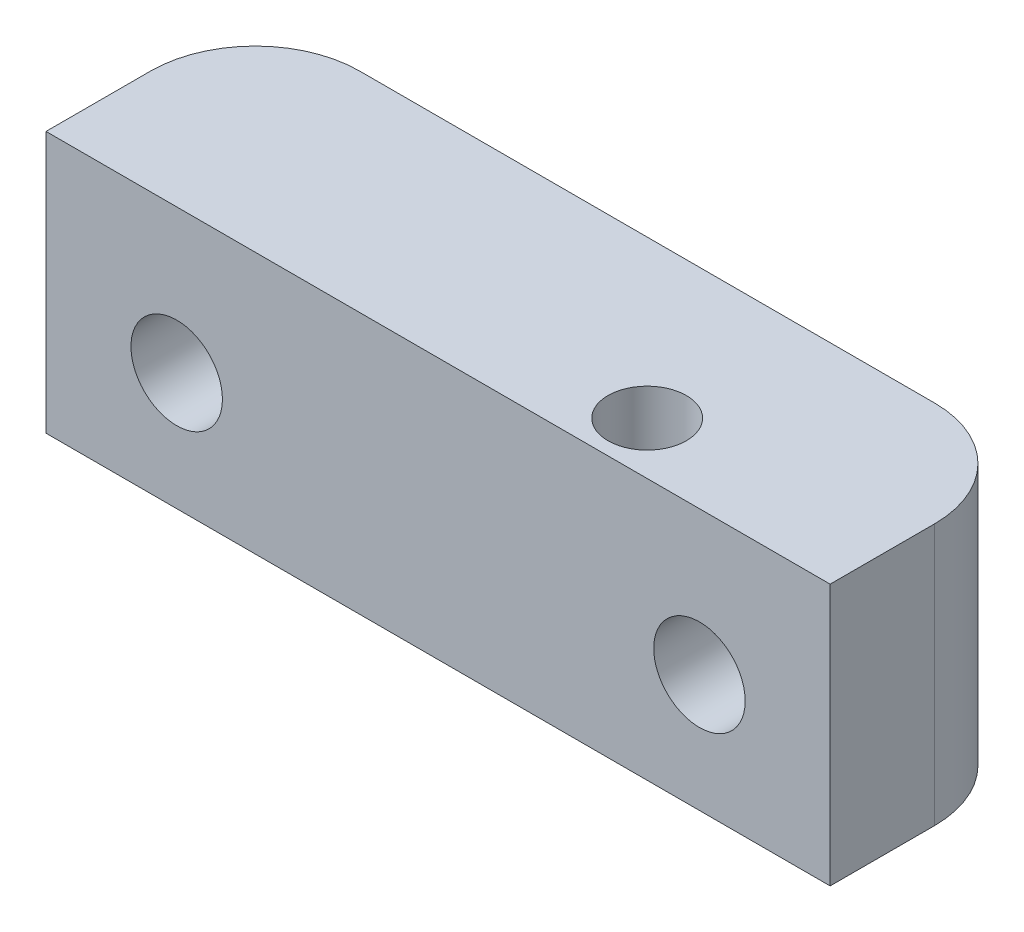
ISO-10303-21;
HEADER;
FILE_DESCRIPTION(('STEP AP214'),'2;1');
FILE_NAME('part.step','',(''),(''),'','','');
FILE_SCHEMA(('AUTOMOTIVE_DESIGN { 1 0 10303 214 1 1 1 1 }'));
ENDSEC;
DATA;
#1=APPLICATION_CONTEXT('core data for automotive mechanical design processes');
#2=APPLICATION_PROTOCOL_DEFINITION('international standard','automotive_design',2000,#1);
#3=PRODUCT_CONTEXT('',#1,'mechanical');
#4=PRODUCT('Part','Part','',(#3));
#5=PRODUCT_RELATED_PRODUCT_CATEGORY('part','',(#4));
#6=PRODUCT_DEFINITION_FORMATION('','',#4);
#7=PRODUCT_DEFINITION_CONTEXT('part definition',#1,'design');
#8=PRODUCT_DEFINITION('design','',#6,#7);
#9=PRODUCT_DEFINITION_SHAPE('','',#8);
#10=(LENGTH_UNIT() NAMED_UNIT(*) SI_UNIT(.MILLI.,.METRE.));
#11=(NAMED_UNIT(*) PLANE_ANGLE_UNIT() SI_UNIT($,.RADIAN.));
#12=(NAMED_UNIT(*) SI_UNIT($,.STERADIAN.) SOLID_ANGLE_UNIT());
#13=UNCERTAINTY_MEASURE_WITH_UNIT(LENGTH_MEASURE(1.E-05),#10,'distance_accuracy_value','');
#14=(GEOMETRIC_REPRESENTATION_CONTEXT(3) GLOBAL_UNCERTAINTY_ASSIGNED_CONTEXT((#13)) GLOBAL_UNIT_ASSIGNED_CONTEXT((#10,
#11,#12)) REPRESENTATION_CONTEXT('',''));
#15=CARTESIAN_POINT('',(0.,0.,0.));
#16=DIRECTION('',(0.,0.,1.));
#17=DIRECTION('',(1.,0.,0.));
#18=AXIS2_PLACEMENT_3D('',#15,#16,#17);
#19=CARTESIAN_POINT('',(0.,2.,0.));
#20=DIRECTION('',(0.,1.,0.));
#21=DIRECTION('',(0.,0.,1.));
#22=AXIS2_PLACEMENT_3D('',#19,#20,#21);
#23=PLANE('',#22);
#24=DIRECTION('',(0.,0.,-1.));
#25=VECTOR('',#24,1.);
#26=CARTESIAN_POINT('',(15.,2.,-4.));
#27=LINE('',#26,#25);
#28=CARTESIAN_POINT('',(15.,2.,4.));
#29=VERTEX_POINT('',#28);
#30=CARTESIAN_POINT('',(15.,2.,0.));
#31=VERTEX_POINT('',#30);
#32=EDGE_CURVE('E147',#29,#31,#27,.T.);
#33=ORIENTED_EDGE('',*,*,#32,.T.);
#34=CARTESIAN_POINT('',(11.,2.,0.));
#35=DIRECTION('',(0.,1.,0.));
#36=DIRECTION('',(0.,0.,1.));
#37=AXIS2_PLACEMENT_3D('',#34,#35,#36);
#38=CIRCLE('',#37,4.);
#39=CARTESIAN_POINT('',(11.,2.,-4.));
#40=VERTEX_POINT('',#39);
#41=EDGE_CURVE('E210',#31,#40,#38,.T.);
#42=ORIENTED_EDGE('',*,*,#41,.T.);
#43=DIRECTION('',(-1.,0.,0.));
#44=VECTOR('',#43,1.);
#45=CARTESIAN_POINT('',(-15.,2.,-4.));
#46=LINE('',#45,#44);
#47=CARTESIAN_POINT('',(-11.,2.,-4.));
#48=VERTEX_POINT('',#47);
#49=EDGE_CURVE('E149',#40,#48,#46,.T.);
#50=ORIENTED_EDGE('',*,*,#49,.T.);
#51=CARTESIAN_POINT('',(-11.,2.,0.));
#52=DIRECTION('',(0.,1.,0.));
#53=DIRECTION('',(0.,0.,1.));
#54=AXIS2_PLACEMENT_3D('',#51,#52,#53);
#55=CIRCLE('',#54,4.);
#56=CARTESIAN_POINT('',(-15.,2.,0.));
#57=VERTEX_POINT('',#56);
#58=EDGE_CURVE('E55',#48,#57,#55,.T.);
#59=ORIENTED_EDGE('',*,*,#58,.T.);
#60=DIRECTION('',(0.,0.,1.));
#61=VECTOR('',#60,1.);
#62=CARTESIAN_POINT('',(-15.,2.,-4.));
#63=LINE('',#62,#61);
#64=CARTESIAN_POINT('',(-15.,2.,4.));
#65=VERTEX_POINT('',#64);
#66=EDGE_CURVE('E151',#57,#65,#63,.T.);
#67=ORIENTED_EDGE('',*,*,#66,.T.);
#68=DIRECTION('',(1.,0.,0.));
#69=VECTOR('',#68,1.);
#70=CARTESIAN_POINT('',(-15.,2.,4.));
#71=LINE('',#70,#69);
#72=EDGE_CURVE('E124',#65,#29,#71,.T.);
#73=ORIENTED_EDGE('',*,*,#72,.T.);
#74=EDGE_LOOP('',(#33,#42,#50,#59,#67,#73));
#75=FACE_BOUND('',#74,.T.);
#76=CARTESIAN_POINT('',(5.99999999999999,2.,2.));
#77=DIRECTION('',(0.,1.,0.));
#78=DIRECTION('',(0.,0.,1.));
#79=AXIS2_PLACEMENT_3D('',#76,#77,#78);
#80=CIRCLE('',#79,1.5);
#81=CARTESIAN_POINT('',(5.99999999999999,2.,3.5));
#82=VERTEX_POINT('',#81);
#83=EDGE_CURVE('E144',#82,#82,#80,.T.);
#84=ORIENTED_EDGE('',*,*,#83,.F.);
#85=EDGE_LOOP('',(#84));
#86=FACE_BOUND('',#85,.T.);
#87=ADVANCED_FACE('F34',(#75,#86),#23,.T.);
#88=CARTESIAN_POINT('',(15.,2.,-4.));
#89=DIRECTION('',(-1.,0.,0.));
#90=DIRECTION('',(0.,0.,1.));
#91=AXIS2_PLACEMENT_3D('',#88,#89,#90);
#92=PLANE('',#91);
#93=DIRECTION('',(0.,0.,1.));
#94=VECTOR('',#93,1.);
#95=CARTESIAN_POINT('',(15.,-8.,-35.0483493925201));
#96=LINE('',#95,#94);
#97=CARTESIAN_POINT('',(15.,-8.,0.));
#98=VERTEX_POINT('',#97);
#99=CARTESIAN_POINT('',(15.,-8.,4.));
#100=VERTEX_POINT('',#99);
#101=EDGE_CURVE('E116',#98,#100,#96,.T.);
#102=ORIENTED_EDGE('',*,*,#101,.F.);
#103=DIRECTION('',(0.,-1.,0.));
#104=VECTOR('',#103,1.);
#105=CARTESIAN_POINT('',(15.,2.,0.));
#106=LINE('',#105,#104);
#107=EDGE_CURVE('E63',#98,#31,#106,.F.);
#108=ORIENTED_EDGE('',*,*,#107,.T.);
#109=ORIENTED_EDGE('',*,*,#32,.F.);
#110=DIRECTION('',(0.,-1.,0.));
#111=VECTOR('',#110,1.);
#112=CARTESIAN_POINT('',(15.,2.,4.));
#113=LINE('',#112,#111);
#114=EDGE_CURVE('E126',#29,#100,#113,.T.);
#115=ORIENTED_EDGE('',*,*,#114,.T.);
#116=EDGE_LOOP('',(#102,#108,#109,#115));
#117=FACE_BOUND('',#116,.T.);
#118=ADVANCED_FACE('F193',(#117),#92,.F.);
#119=CARTESIAN_POINT('',(-15.,2.,-4.));
#120=DIRECTION('',(0.,0.,1.));
#121=DIRECTION('',(1.,0.,0.));
#122=AXIS2_PLACEMENT_3D('',#119,#120,#121);
#123=PLANE('',#122);
#124=ORIENTED_EDGE('',*,*,#49,.F.);
#125=DIRECTION('',(0.,-1.,0.));
#126=VECTOR('',#125,1.);
#127=CARTESIAN_POINT('',(11.,2.,-4.));
#128=LINE('',#127,#126);
#129=CARTESIAN_POINT('',(11.,-2.06385933836549,-4.));
#130=VERTEX_POINT('',#129);
#131=EDGE_CURVE('E160',#40,#130,#128,.T.);
#132=ORIENTED_EDGE('',*,*,#131,.T.);
#133=CARTESIAN_POINT('',(10.,-3.5,-4.));
#134=DIRECTION('',(0.,0.,1.));
#135=DIRECTION('',(1.,0.,0.));
#136=AXIS2_PLACEMENT_3D('',#133,#134,#135);
#137=CIRCLE('',#136,1.75);
#138=CARTESIAN_POINT('',(11.,-4.93614066163451,-4.));
#139=VERTEX_POINT('',#138);
#140=EDGE_CURVE('E140',#139,#130,#137,.F.);
#141=ORIENTED_EDGE('',*,*,#140,.F.);
#142=DIRECTION('',(0.,-1.,0.));
#143=VECTOR('',#142,1.);
#144=CARTESIAN_POINT('',(11.,2.,-4.));
#145=LINE('',#144,#143);
#146=CARTESIAN_POINT('',(11.,-8.,-4.));
#147=VERTEX_POINT('',#146);
#148=EDGE_CURVE('E158',#139,#147,#145,.T.);
#149=ORIENTED_EDGE('',*,*,#148,.T.);
#150=DIRECTION('',(-1.,0.,0.));
#151=VECTOR('',#150,1.);
#152=CARTESIAN_POINT('',(15.,-8.,-4.));
#153=LINE('',#152,#151);
#154=CARTESIAN_POINT('',(-11.,-8.,-4.));
#155=VERTEX_POINT('',#154);
#156=EDGE_CURVE('E138',#147,#155,#153,.T.);
#157=ORIENTED_EDGE('',*,*,#156,.T.);
#158=DIRECTION('',(0.,-1.,0.));
#159=VECTOR('',#158,1.);
#160=CARTESIAN_POINT('',(-11.,2.,-4.));
#161=LINE('',#160,#159);
#162=CARTESIAN_POINT('',(-11.,-4.9361406616345,-4.));
#163=VERTEX_POINT('',#162);
#164=EDGE_CURVE('E156',#155,#163,#161,.F.);
#165=ORIENTED_EDGE('',*,*,#164,.T.);
#166=CARTESIAN_POINT('',(-10.,-3.5,-4.));
#167=DIRECTION('',(0.,0.,1.));
#168=DIRECTION('',(1.,0.,0.));
#169=AXIS2_PLACEMENT_3D('',#166,#167,#168);
#170=CIRCLE('',#169,1.75);
#171=CARTESIAN_POINT('',(-11.,-2.0638593383655,-4.));
#172=VERTEX_POINT('',#171);
#173=EDGE_CURVE('E143',#172,#163,#170,.F.);
#174=ORIENTED_EDGE('',*,*,#173,.F.);
#175=DIRECTION('',(0.,-1.,0.));
#176=VECTOR('',#175,1.);
#177=CARTESIAN_POINT('',(-11.,2.,-4.));
#178=LINE('',#177,#176);
#179=EDGE_CURVE('E125',#172,#48,#178,.F.);
#180=ORIENTED_EDGE('',*,*,#179,.T.);
#181=EDGE_LOOP('',(#124,#132,#141,#149,#157,#165,#174,#180));
#182=FACE_BOUND('',#181,.T.);
#183=ADVANCED_FACE('F198',(#182),#123,.F.);
#184=CARTESIAN_POINT('',(-15.,2.,-4.));
#185=DIRECTION('',(1.,0.,0.));
#186=DIRECTION('',(0.,0.,-1.));
#187=AXIS2_PLACEMENT_3D('',#184,#185,#186);
#188=PLANE('',#187);
#189=ORIENTED_EDGE('',*,*,#66,.F.);
#190=DIRECTION('',(0.,-1.,0.));
#191=VECTOR('',#190,1.);
#192=CARTESIAN_POINT('',(-15.,2.,0.));
#193=LINE('',#192,#191);
#194=CARTESIAN_POINT('',(-15.,-8.,0.));
#195=VERTEX_POINT('',#194);
#196=EDGE_CURVE('E48',#57,#195,#193,.T.);
#197=ORIENTED_EDGE('',*,*,#196,.T.);
#198=DIRECTION('',(0.,0.,1.));
#199=VECTOR('',#198,1.);
#200=CARTESIAN_POINT('',(-15.,-8.,-35.0483493925201));
#201=LINE('',#200,#199);
#202=CARTESIAN_POINT('',(-15.,-8.,4.));
#203=VERTEX_POINT('',#202);
#204=EDGE_CURVE('E108',#195,#203,#201,.T.);
#205=ORIENTED_EDGE('',*,*,#204,.T.);
#206=DIRECTION('',(0.,-1.,0.));
#207=VECTOR('',#206,1.);
#208=CARTESIAN_POINT('',(-15.,2.,4.));
#209=LINE('',#208,#207);
#210=EDGE_CURVE('E111',#65,#203,#209,.T.);
#211=ORIENTED_EDGE('',*,*,#210,.F.);
#212=EDGE_LOOP('',(#189,#197,#205,#211));
#213=FACE_BOUND('',#212,.T.);
#214=ADVANCED_FACE('F110',(#213),#188,.F.);
#215=CARTESIAN_POINT('',(-15.,2.,4.));
#216=DIRECTION('',(0.,0.,-1.));
#217=DIRECTION('',(-1.,0.,0.));
#218=AXIS2_PLACEMENT_3D('',#215,#216,#217);
#219=PLANE('',#218);
#220=ORIENTED_EDGE('',*,*,#210,.T.);
#221=DIRECTION('',(1.,0.,0.));
#222=VECTOR('',#221,1.);
#223=CARTESIAN_POINT('',(15.,-8.,4.));
#224=LINE('',#223,#222);
#225=EDGE_CURVE('E117',#203,#100,#224,.T.);
#226=ORIENTED_EDGE('',*,*,#225,.T.);
#227=ORIENTED_EDGE('',*,*,#114,.F.);
#228=ORIENTED_EDGE('',*,*,#72,.F.);
#229=EDGE_LOOP('',(#220,#226,#227,#228));
#230=FACE_BOUND('',#229,.T.);
#231=CARTESIAN_POINT('',(10.,-3.5,4.));
#232=DIRECTION('',(0.,0.,1.));
#233=DIRECTION('',(1.,0.,0.));
#234=AXIS2_PLACEMENT_3D('',#231,#232,#233);
#235=CIRCLE('',#234,1.75);
#236=CARTESIAN_POINT('',(11.75,-3.5,4.));
#237=VERTEX_POINT('',#236);
#238=EDGE_CURVE('E134',#237,#237,#235,.T.);
#239=ORIENTED_EDGE('',*,*,#238,.F.);
#240=EDGE_LOOP('',(#239));
#241=FACE_BOUND('',#240,.T.);
#242=CARTESIAN_POINT('',(-10.,-3.5,4.));
#243=DIRECTION('',(0.,0.,1.));
#244=DIRECTION('',(1.,0.,0.));
#245=AXIS2_PLACEMENT_3D('',#242,#243,#244);
#246=CIRCLE('',#245,1.75);
#247=CARTESIAN_POINT('',(-8.25,-3.5,4.));
#248=VERTEX_POINT('',#247);
#249=EDGE_CURVE('E131',#248,#248,#246,.T.);
#250=ORIENTED_EDGE('',*,*,#249,.F.);
#251=EDGE_LOOP('',(#250));
#252=FACE_BOUND('',#251,.T.);
#253=ADVANCED_FACE('F121',(#230,#241,#252),#219,.F.);
#254=CARTESIAN_POINT('',(5.99999999999999,2.,2.));
#255=DIRECTION('',(0.,-1.,0.));
#256=DIRECTION('',(0.,0.,-1.));
#257=AXIS2_PLACEMENT_3D('',#254,#255,#256);
#258=CYLINDRICAL_SURFACE('',#257,1.5);
#259=ORIENTED_EDGE('',*,*,#83,.T.);
#260=EDGE_LOOP('',(#259));
#261=FACE_BOUND('',#260,.T.);
#262=CARTESIAN_POINT('',(5.99999999999999,-8.,2.));
#263=DIRECTION('',(0.,1.,0.));
#264=DIRECTION('',(0.,0.,1.));
#265=AXIS2_PLACEMENT_3D('',#262,#263,#264);
#266=CIRCLE('',#265,1.5);
#267=CARTESIAN_POINT('',(5.99999999999999,-8.,3.5));
#268=VERTEX_POINT('',#267);
#269=EDGE_CURVE('E226',#268,#268,#266,.T.);
#270=ORIENTED_EDGE('',*,*,#269,.F.);
#271=EDGE_LOOP('',(#270));
#272=FACE_BOUND('',#271,.T.);
#273=ADVANCED_FACE('F186',(#261,#272),#258,.F.);
#274=CARTESIAN_POINT('',(15.,-8.,-35.0483493925201));
#275=DIRECTION('',(0.,-1.,0.));
#276=DIRECTION('',(0.,0.,-1.));
#277=AXIS2_PLACEMENT_3D('',#274,#275,#276);
#278=PLANE('',#277);
#279=ORIENTED_EDGE('',*,*,#269,.T.);
#280=EDGE_LOOP('',(#279));
#281=FACE_BOUND('',#280,.T.);
#282=ORIENTED_EDGE('',*,*,#156,.F.);
#283=CARTESIAN_POINT('',(11.,-8.,0.));
#284=DIRECTION('',(0.,-1.,0.));
#285=DIRECTION('',(0.,0.,-1.));
#286=AXIS2_PLACEMENT_3D('',#283,#284,#285);
#287=CIRCLE('',#286,4.);
#288=EDGE_CURVE('E208',#147,#98,#287,.T.);
#289=ORIENTED_EDGE('',*,*,#288,.T.);
#290=ORIENTED_EDGE('',*,*,#101,.T.);
#291=ORIENTED_EDGE('',*,*,#225,.F.);
#292=ORIENTED_EDGE('',*,*,#204,.F.);
#293=CARTESIAN_POINT('',(-11.,-8.,0.));
#294=DIRECTION('',(0.,-1.,0.));
#295=DIRECTION('',(0.,0.,-1.));
#296=AXIS2_PLACEMENT_3D('',#293,#294,#295);
#297=CIRCLE('',#296,4.);
#298=EDGE_CURVE('E170',#195,#155,#297,.T.);
#299=ORIENTED_EDGE('',*,*,#298,.T.);
#300=EDGE_LOOP('',(#282,#289,#290,#291,#292,#299));
#301=FACE_BOUND('',#300,.T.);
#302=ADVANCED_FACE('F129',(#281,#301),#278,.T.);
#303=CARTESIAN_POINT('',(-10.,-3.5,-35.0483493925201));
#304=DIRECTION('',(0.,0.,1.));
#305=DIRECTION('',(1.,0.,0.));
#306=AXIS2_PLACEMENT_3D('',#303,#304,#305);
#307=CYLINDRICAL_SURFACE('',#306,1.75);
#308=ORIENTED_EDGE('',*,*,#173,.T.);
#309=CARTESIAN_POINT('',(-11.,-4.9361406616345,-4.));
#310=CARTESIAN_POINT('',(-11.0401527299549,-4.90818256903385,-4.00000144220158));
#311=CARTESIAN_POINT('',(-11.0791082928797,-4.87855499310264,-3.99939523801925));
#312=CARTESIAN_POINT('',(-11.1543789053615,-4.81616854274351,-3.99719676930283));
#313=CARTESIAN_POINT('',(-11.1906946759705,-4.78341052908793,-3.9956047751741));
#314=CARTESIAN_POINT('',(-11.2952102453348,-4.68086029569801,-3.98970080811822));
#315=CARTESIAN_POINT('',(-11.3591355888091,-4.60668205309868,-3.98425907710527));
#316=CARTESIAN_POINT('',(-11.4736645053193,-4.44885768569416,-3.97227559521206));
#317=CARTESIAN_POINT('',(-11.5242725728132,-4.36521476879278,-3.96573421667731));
#318=CARTESIAN_POINT('',(-11.6109054239153,-4.19063192340139,-3.95331692062189));
#319=CARTESIAN_POINT('',(-11.646931009606,-4.09969239657771,-3.94744096651359));
#320=CARTESIAN_POINT('',(-11.7036697385481,-3.91197736188191,-3.9377272574376));
#321=CARTESIAN_POINT('',(-11.7242153446737,-3.81514992488849,-3.93391192600725));
#322=CARTESIAN_POINT('',(-11.7487109251733,-3.61934187526397,-3.92932457250113));
#323=CARTESIAN_POINT('',(-11.7526614337243,-3.52036133204194,-3.92855245246796));
#324=CARTESIAN_POINT('',(-11.7439134665748,-3.32482720501767,-3.93021740598621));
#325=CARTESIAN_POINT('',(-11.7314910829314,-3.22826065100876,-3.93260126405224));
#326=CARTESIAN_POINT('',(-11.6908634810028,-3.03860277304037,-3.93994009814539));
#327=CARTESIAN_POINT('',(-11.6626563105523,-2.94551188044861,-3.94489539218636));
#328=CARTESIAN_POINT('',(-11.591159153847,-2.76503665747912,-3.95624039602574));
#329=CARTESIAN_POINT('',(-11.5478156113038,-2.6776739159914,-3.96263517012704));
#330=CARTESIAN_POINT('',(-11.4472447203083,-2.51135573174655,-3.97523954207111));
#331=CARTESIAN_POINT('',(-11.3900240788421,-2.43239625402619,-3.98144922774645));
#332=CARTESIAN_POINT('',(-11.2787016128893,-2.30299265109288,-3.99056758636302));
#333=CARTESIAN_POINT('',(-11.2272377728008,-2.25028860227729,-3.99391192174119));
#334=CARTESIAN_POINT('',(-11.1180878681767,-2.15174149400115,-3.99863148983007));
#335=CARTESIAN_POINT('',(-11.0604050322817,-2.10589490367113,-4.00000773904488));
#336=CARTESIAN_POINT('',(-11.,-2.0638593383655,-4.));
#337=B_SPLINE_CURVE_WITH_KNOTS('',3,(#309,#310,#311,#312,#313,#314,#315,#316,#317,#318,#319,
#320,#321,#322,#323,#324,#325,#326,#327,#328,#329,#330,#331,#332,#333,#334,#335,#336),
.UNSPECIFIED.,.F.,.F.,(4,2,2,2,2,2,2,2,2,2,2,2,2,4),(0.,0.146682065347719,0.293323913143241,
0.586039603959889,0.878656378855871,1.1712570567186,1.46698072798465,1.76269488017545,
2.05348572044707,2.34431253188889,2.63617896567408,2.92790461668136,3.14853997784128,
3.36906134101682),.UNSPECIFIED.);
#338=EDGE_CURVE('E11',#163,#172,#337,.T.);
#339=ORIENTED_EDGE('',*,*,#338,.T.);
#340=EDGE_LOOP('',(#308,#339));
#341=FACE_BOUND('',#340,.T.);
#342=ORIENTED_EDGE('',*,*,#249,.T.);
#343=EDGE_LOOP('',(#342));
#344=FACE_BOUND('',#343,.T.);
#345=ADVANCED_FACE('F178',(#341,#344),#307,.F.);
#346=CARTESIAN_POINT('',(10.,-3.5,-35.0483493925201));
#347=DIRECTION('',(0.,0.,1.));
#348=DIRECTION('',(1.,0.,0.));
#349=AXIS2_PLACEMENT_3D('',#346,#347,#348);
#350=CYLINDRICAL_SURFACE('',#349,1.75);
#351=ORIENTED_EDGE('',*,*,#140,.T.);
#352=CARTESIAN_POINT('',(11.,-2.06385933836549,-4.));
#353=CARTESIAN_POINT('',(11.0401527299549,-2.09181743096614,-4.00000144220158));
#354=CARTESIAN_POINT('',(11.0791082928797,-2.12144500689736,-3.99939523801925));
#355=CARTESIAN_POINT('',(11.1543789053615,-2.18383145725648,-3.99719676930283));
#356=CARTESIAN_POINT('',(11.1906946759705,-2.21658947091207,-3.9956047751741));
#357=CARTESIAN_POINT('',(11.2952102453348,-2.31913970430198,-3.98970080811822));
#358=CARTESIAN_POINT('',(11.3591355888091,-2.3933179469013,-3.98425907710527));
#359=CARTESIAN_POINT('',(11.4736645053192,-2.55114231430582,-3.97227559521206));
#360=CARTESIAN_POINT('',(11.5242725728132,-2.63478523120721,-3.96573421667731));
#361=CARTESIAN_POINT('',(11.6109054239153,-2.8093680765986,-3.95331692062189));
#362=CARTESIAN_POINT('',(11.646931009606,-2.90030760342227,-3.94744096651359));
#363=CARTESIAN_POINT('',(11.7036697385481,-3.08802263811808,-3.9377272574376));
#364=CARTESIAN_POINT('',(11.7242153446737,-3.18485007511149,-3.93391192600725));
#365=CARTESIAN_POINT('',(11.7487109251733,-3.38065812473602,-3.92932457250113));
#366=CARTESIAN_POINT('',(11.7526614337243,-3.47963866795804,-3.92855245246795));
#367=CARTESIAN_POINT('',(11.7439134665748,-3.67517279498232,-3.9302174059862));
#368=CARTESIAN_POINT('',(11.7314910829314,-3.77173934899123,-3.93260126405224));
#369=CARTESIAN_POINT('',(11.6908634810028,-3.96139722695962,-3.93994009814539));
#370=CARTESIAN_POINT('',(11.6626563105523,-4.05448811955137,-3.94489539218635));
#371=CARTESIAN_POINT('',(11.591159153847,-4.23496334252087,-3.95624039602574));
#372=CARTESIAN_POINT('',(11.5478156113038,-4.32232608400859,-3.96263517012703));
#373=CARTESIAN_POINT('',(11.4472447203083,-4.48864426825344,-3.9752395420711));
#374=CARTESIAN_POINT('',(11.3900240788421,-4.56760374597379,-3.98144922774644));
#375=CARTESIAN_POINT('',(11.2787016128893,-4.69700734890712,-3.99056758636302));
#376=CARTESIAN_POINT('',(11.2272377728008,-4.74971139772271,-3.99391192174119));
#377=CARTESIAN_POINT('',(11.1180878681767,-4.84825850599885,-3.99863148983007));
#378=CARTESIAN_POINT('',(11.0604050322817,-4.89410509632887,-4.00000773904488));
#379=CARTESIAN_POINT('',(11.,-4.93614066163451,-4.));
#380=B_SPLINE_CURVE_WITH_KNOTS('',3,(#352,#353,#354,#355,#356,#357,#358,#359,#360,#361,#362,
#363,#364,#365,#366,#367,#368,#369,#370,#371,#372,#373,#374,#375,#376,#377,#378,#379),
.UNSPECIFIED.,.F.,.F.,(4,2,2,2,2,2,2,2,2,2,2,2,2,4),(0.,0.146682065347721,0.293323913143244,
0.586039603959889,0.87865637885587,1.1712570567186,1.46698072798465,1.76269488017545,
2.05348572044707,2.34431253188889,2.63617896567408,2.92790461668136,3.14853997784129,
3.36906134101685),.UNSPECIFIED.);
#381=EDGE_CURVE('E163',#130,#139,#380,.T.);
#382=ORIENTED_EDGE('',*,*,#381,.T.);
#383=EDGE_LOOP('',(#351,#382));
#384=FACE_BOUND('',#383,.T.);
#385=ORIENTED_EDGE('',*,*,#238,.T.);
#386=EDGE_LOOP('',(#385));
#387=FACE_BOUND('',#386,.T.);
#388=ADVANCED_FACE('F175',(#384,#387),#350,.F.);
#389=CARTESIAN_POINT('',(11.,2.,0.));
#390=DIRECTION('',(0.,-1.,0.));
#391=DIRECTION('',(0.,0.,-1.));
#392=AXIS2_PLACEMENT_3D('',#389,#390,#391);
#393=CYLINDRICAL_SURFACE('',#392,4.);
#394=ORIENTED_EDGE('',*,*,#41,.F.);
#395=ORIENTED_EDGE('',*,*,#107,.F.);
#396=ORIENTED_EDGE('',*,*,#288,.F.);
#397=ORIENTED_EDGE('',*,*,#148,.F.);
#398=ORIENTED_EDGE('',*,*,#381,.F.);
#399=ORIENTED_EDGE('',*,*,#131,.F.);
#400=EDGE_LOOP('',(#394,#395,#396,#397,#398,#399));
#401=FACE_BOUND('',#400,.T.);
#402=ADVANCED_FACE('F172',(#401),#393,.T.);
#403=CARTESIAN_POINT('',(-11.,2.,0.));
#404=DIRECTION('',(0.,-1.,0.));
#405=DIRECTION('',(0.,0.,-1.));
#406=AXIS2_PLACEMENT_3D('',#403,#404,#405);
#407=CYLINDRICAL_SURFACE('',#406,4.);
#408=ORIENTED_EDGE('',*,*,#338,.F.);
#409=ORIENTED_EDGE('',*,*,#164,.F.);
#410=ORIENTED_EDGE('',*,*,#298,.F.);
#411=ORIENTED_EDGE('',*,*,#196,.F.);
#412=ORIENTED_EDGE('',*,*,#58,.F.);
#413=ORIENTED_EDGE('',*,*,#179,.F.);
#414=EDGE_LOOP('',(#408,#409,#410,#411,#412,#413));
#415=FACE_BOUND('',#414,.T.);
#416=ADVANCED_FACE('F36',(#415),#407,.T.);
#417=CLOSED_SHELL('',(#87,#118,#183,#214,#253,#273,#302,#345,#388,#402,#416));
#418=MANIFOLD_SOLID_BREP('B2',#417);
#419=ADVANCED_BREP_SHAPE_REPRESENTATION('',(#18,#418),#14);
#420=SHAPE_DEFINITION_REPRESENTATION(#9,#419);
ENDSEC;
END-ISO-10303-21;
